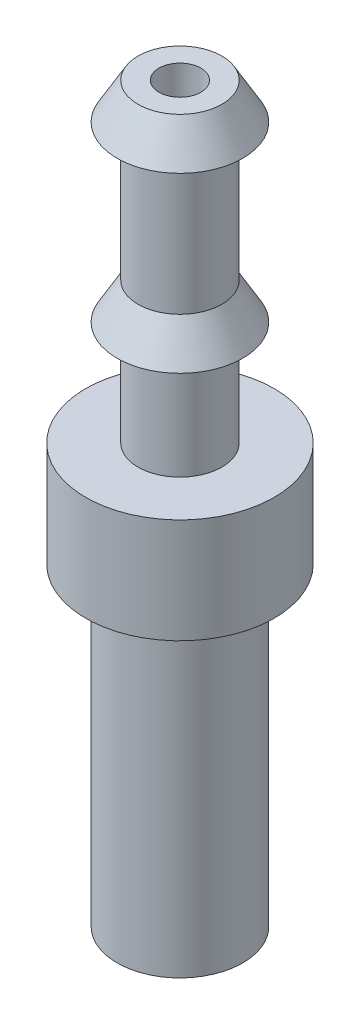
ISO-10303-21;
HEADER;
FILE_DESCRIPTION(('STEP AP214'),'2;1');
FILE_NAME('part.step','',(''),(''),'','','');
FILE_SCHEMA(('AUTOMOTIVE_DESIGN { 1 0 10303 214 1 1 1 1 }'));
ENDSEC;
DATA;
#1=APPLICATION_CONTEXT('core data for automotive mechanical design processes');
#2=APPLICATION_PROTOCOL_DEFINITION('international standard','automotive_design',2000,#1);
#3=PRODUCT_CONTEXT('',#1,'mechanical');
#4=PRODUCT('Part','Part','',(#3));
#5=PRODUCT_RELATED_PRODUCT_CATEGORY('part','',(#4));
#6=PRODUCT_DEFINITION_FORMATION('','',#4);
#7=PRODUCT_DEFINITION_CONTEXT('part definition',#1,'design');
#8=PRODUCT_DEFINITION('design','',#6,#7);
#9=PRODUCT_DEFINITION_SHAPE('','',#8);
#10=(LENGTH_UNIT() NAMED_UNIT(*) SI_UNIT(.MILLI.,.METRE.));
#11=(NAMED_UNIT(*) PLANE_ANGLE_UNIT() SI_UNIT($,.RADIAN.));
#12=(NAMED_UNIT(*) SI_UNIT($,.STERADIAN.) SOLID_ANGLE_UNIT());
#13=UNCERTAINTY_MEASURE_WITH_UNIT(LENGTH_MEASURE(1.E-05),#10,'distance_accuracy_value','');
#14=(GEOMETRIC_REPRESENTATION_CONTEXT(3) GLOBAL_UNCERTAINTY_ASSIGNED_CONTEXT((#13)) GLOBAL_UNIT_ASSIGNED_CONTEXT((#10,
#11,#12)) REPRESENTATION_CONTEXT('',''));
#15=CARTESIAN_POINT('',(0.,0.,0.));
#16=DIRECTION('',(0.,0.,1.));
#17=DIRECTION('',(1.,0.,0.));
#18=AXIS2_PLACEMENT_3D('',#15,#16,#17);
#19=CARTESIAN_POINT('',(0.,0.,0.));
#20=DIRECTION('',(0.,-1.,0.));
#21=DIRECTION('',(0.,0.,-1.));
#22=AXIS2_PLACEMENT_3D('',#19,#20,#21);
#23=CYLINDRICAL_SURFACE('',#22,3.);
#24=CARTESIAN_POINT('',(0.,-15.,0.));
#25=DIRECTION('',(0.,-1.,0.));
#26=DIRECTION('',(0.,0.,-1.));
#27=AXIS2_PLACEMENT_3D('',#24,#25,#26);
#28=CIRCLE('',#27,3.);
#29=CARTESIAN_POINT('',(0.,-15.,-3.));
#30=VERTEX_POINT('',#29);
#31=EDGE_CURVE('E10',#30,#30,#28,.T.);
#32=ORIENTED_EDGE('',*,*,#31,.F.);
#33=EDGE_LOOP('',(#32));
#34=FACE_BOUND('',#33,.T.);
#35=CARTESIAN_POINT('',(0.,0.,0.));
#36=DIRECTION('',(0.,-1.,0.));
#37=DIRECTION('',(0.,0.,-1.));
#38=AXIS2_PLACEMENT_3D('',#35,#36,#37);
#39=CIRCLE('',#38,3.);
#40=CARTESIAN_POINT('',(0.,0.,-3.));
#41=VERTEX_POINT('',#40);
#42=EDGE_CURVE('E78',#41,#41,#39,.T.);
#43=ORIENTED_EDGE('',*,*,#42,.T.);
#44=EDGE_LOOP('',(#43));
#45=FACE_BOUND('',#44,.T.);
#46=ADVANCED_FACE('F35',(#34,#45),#23,.T.);
#47=CARTESIAN_POINT('',(-0.999999999999998,-15.,0.));
#48=DIRECTION('',(0.,1.,0.));
#49=DIRECTION('',(0.,0.,1.));
#50=AXIS2_PLACEMENT_3D('',#47,#48,#49);
#51=PLANE('',#50);
#52=CARTESIAN_POINT('',(0.,-15.,0.));
#53=DIRECTION('',(0.,-1.,0.));
#54=DIRECTION('',(0.,0.,-1.));
#55=AXIS2_PLACEMENT_3D('',#52,#53,#54);
#56=CIRCLE('',#55,0.999999999999998);
#57=CARTESIAN_POINT('',(0.,-15.,-0.999999999999998));
#58=VERTEX_POINT('',#57);
#59=EDGE_CURVE('E41',#58,#58,#56,.T.);
#60=ORIENTED_EDGE('',*,*,#59,.F.);
#61=EDGE_LOOP('',(#60));
#62=FACE_BOUND('',#61,.T.);
#63=ORIENTED_EDGE('',*,*,#31,.T.);
#64=EDGE_LOOP('',(#63));
#65=FACE_BOUND('',#64,.T.);
#66=ADVANCED_FACE('F145',(#62,#65),#51,.F.);
#67=CARTESIAN_POINT('',(0.,0.,0.));
#68=DIRECTION('',(0.,-1.,0.));
#69=DIRECTION('',(0.,0.,-1.));
#70=AXIS2_PLACEMENT_3D('',#67,#68,#69);
#71=CYLINDRICAL_SURFACE('',#70,1.);
#72=CARTESIAN_POINT('',(0.,20.,0.));
#73=DIRECTION('',(0.,-1.,0.));
#74=DIRECTION('',(0.,0.,-1.));
#75=AXIS2_PLACEMENT_3D('',#72,#73,#74);
#76=CIRCLE('',#75,1.);
#77=CARTESIAN_POINT('',(0.,20.,-1.));
#78=VERTEX_POINT('',#77);
#79=EDGE_CURVE('E45',#78,#78,#76,.T.);
#80=ORIENTED_EDGE('',*,*,#79,.F.);
#81=EDGE_LOOP('',(#80));
#82=FACE_BOUND('',#81,.T.);
#83=ORIENTED_EDGE('',*,*,#59,.T.);
#84=EDGE_LOOP('',(#83));
#85=FACE_BOUND('',#84,.T.);
#86=ADVANCED_FACE('F140',(#82,#85),#71,.F.);
#87=CARTESIAN_POINT('',(-2.,20.,0.));
#88=DIRECTION('',(0.,-1.,0.));
#89=DIRECTION('',(0.,0.,-1.));
#90=AXIS2_PLACEMENT_3D('',#87,#88,#89);
#91=PLANE('',#90);
#92=CARTESIAN_POINT('',(0.,20.,0.));
#93=DIRECTION('',(0.,-1.,0.));
#94=DIRECTION('',(0.,0.,-1.));
#95=AXIS2_PLACEMENT_3D('',#92,#93,#94);
#96=CIRCLE('',#95,2.);
#97=CARTESIAN_POINT('',(0.,20.,-2.));
#98=VERTEX_POINT('',#97);
#99=EDGE_CURVE('E49',#98,#98,#96,.T.);
#100=ORIENTED_EDGE('',*,*,#99,.F.);
#101=EDGE_LOOP('',(#100));
#102=FACE_BOUND('',#101,.T.);
#103=ORIENTED_EDGE('',*,*,#79,.T.);
#104=EDGE_LOOP('',(#103));
#105=FACE_BOUND('',#104,.T.);
#106=ADVANCED_FACE('F134',(#102,#105),#91,.F.);
#107=CARTESIAN_POINT('',(0.,20.,0.));
#108=DIRECTION('',(0.,-1.,0.));
#109=DIRECTION('',(0.,0.,-1.));
#110=AXIS2_PLACEMENT_3D('',#107,#108,#109);
#111=CONICAL_SURFACE('',#110,2.,0.523598775598303);
#112=CARTESIAN_POINT('',(0.,18.2679491924311,0.));
#113=DIRECTION('',(0.,-1.,0.));
#114=DIRECTION('',(0.,0.,-1.));
#115=AXIS2_PLACEMENT_3D('',#112,#113,#114);
#116=CIRCLE('',#115,3.);
#117=CARTESIAN_POINT('',(0.,18.2679491924311,-3.));
#118=VERTEX_POINT('',#117);
#119=EDGE_CURVE('E54',#118,#118,#116,.T.);
#120=ORIENTED_EDGE('',*,*,#119,.F.);
#121=EDGE_LOOP('',(#120));
#122=FACE_BOUND('',#121,.T.);
#123=ORIENTED_EDGE('',*,*,#99,.T.);
#124=EDGE_LOOP('',(#123));
#125=FACE_BOUND('',#124,.T.);
#126=ADVANCED_FACE('F128',(#122,#125),#111,.T.);
#127=CARTESIAN_POINT('',(-2.,18.2679491924311,0.));
#128=DIRECTION('',(0.,1.,0.));
#129=DIRECTION('',(0.,0.,1.));
#130=AXIS2_PLACEMENT_3D('',#127,#128,#129);
#131=PLANE('',#130);
#132=CARTESIAN_POINT('',(0.,18.2679491924311,0.));
#133=DIRECTION('',(0.,-1.,0.));
#134=DIRECTION('',(0.,0.,-1.));
#135=AXIS2_PLACEMENT_3D('',#132,#133,#134);
#136=CIRCLE('',#135,2.);
#137=CARTESIAN_POINT('',(0.,18.2679491924311,-2.));
#138=VERTEX_POINT('',#137);
#139=EDGE_CURVE('E57',#138,#138,#136,.T.);
#140=ORIENTED_EDGE('',*,*,#139,.F.);
#141=EDGE_LOOP('',(#140));
#142=FACE_BOUND('',#141,.T.);
#143=ORIENTED_EDGE('',*,*,#119,.T.);
#144=EDGE_LOOP('',(#143));
#145=FACE_BOUND('',#144,.T.);
#146=ADVANCED_FACE('F122',(#142,#145),#131,.F.);
#147=CARTESIAN_POINT('',(0.,0.,0.));
#148=DIRECTION('',(0.,-1.,0.));
#149=DIRECTION('',(0.,0.,-1.));
#150=AXIS2_PLACEMENT_3D('',#147,#148,#149);
#151=CYLINDRICAL_SURFACE('',#150,2.);
#152=CARTESIAN_POINT('',(0.,11.7320508075689,0.));
#153=DIRECTION('',(0.,-1.,0.));
#154=DIRECTION('',(0.,0.,-1.));
#155=AXIS2_PLACEMENT_3D('',#152,#153,#154);
#156=CIRCLE('',#155,2.);
#157=CARTESIAN_POINT('',(0.,11.7320508075689,-2.));
#158=VERTEX_POINT('',#157);
#159=EDGE_CURVE('E60',#158,#158,#156,.T.);
#160=ORIENTED_EDGE('',*,*,#159,.F.);
#161=EDGE_LOOP('',(#160));
#162=FACE_BOUND('',#161,.T.);
#163=ORIENTED_EDGE('',*,*,#139,.T.);
#164=EDGE_LOOP('',(#163));
#165=FACE_BOUND('',#164,.T.);
#166=ADVANCED_FACE('F116',(#162,#165),#151,.T.);
#167=CARTESIAN_POINT('',(0.,11.7320508075689,0.));
#168=DIRECTION('',(0.,-1.,0.));
#169=DIRECTION('',(0.,0.,-1.));
#170=AXIS2_PLACEMENT_3D('',#167,#168,#169);
#171=CONICAL_SURFACE('',#170,2.,0.523598775598304);
#172=CARTESIAN_POINT('',(0.,10.,0.));
#173=DIRECTION('',(0.,-1.,0.));
#174=DIRECTION('',(0.,0.,-1.));
#175=AXIS2_PLACEMENT_3D('',#172,#173,#174);
#176=CIRCLE('',#175,3.);
#177=CARTESIAN_POINT('',(0.,10.,-3.));
#178=VERTEX_POINT('',#177);
#179=EDGE_CURVE('E63',#178,#178,#176,.T.);
#180=ORIENTED_EDGE('',*,*,#179,.F.);
#181=EDGE_LOOP('',(#180));
#182=FACE_BOUND('',#181,.T.);
#183=ORIENTED_EDGE('',*,*,#159,.T.);
#184=EDGE_LOOP('',(#183));
#185=FACE_BOUND('',#184,.T.);
#186=ADVANCED_FACE('F110',(#182,#185),#171,.T.);
#187=CARTESIAN_POINT('',(-2.,10.,0.));
#188=DIRECTION('',(0.,1.,0.));
#189=DIRECTION('',(0.,0.,1.));
#190=AXIS2_PLACEMENT_3D('',#187,#188,#189);
#191=PLANE('',#190);
#192=CARTESIAN_POINT('',(0.,10.,0.));
#193=DIRECTION('',(0.,-1.,0.));
#194=DIRECTION('',(0.,0.,-1.));
#195=AXIS2_PLACEMENT_3D('',#192,#193,#194);
#196=CIRCLE('',#195,2.);
#197=CARTESIAN_POINT('',(0.,10.,-2.));
#198=VERTEX_POINT('',#197);
#199=EDGE_CURVE('E66',#198,#198,#196,.T.);
#200=ORIENTED_EDGE('',*,*,#199,.F.);
#201=EDGE_LOOP('',(#200));
#202=FACE_BOUND('',#201,.T.);
#203=ORIENTED_EDGE('',*,*,#179,.T.);
#204=EDGE_LOOP('',(#203));
#205=FACE_BOUND('',#204,.T.);
#206=ADVANCED_FACE('F104',(#202,#205),#191,.F.);
#207=CARTESIAN_POINT('',(0.,0.,0.));
#208=DIRECTION('',(0.,-1.,0.));
#209=DIRECTION('',(0.,0.,-1.));
#210=AXIS2_PLACEMENT_3D('',#207,#208,#209);
#211=CYLINDRICAL_SURFACE('',#210,2.);
#212=CARTESIAN_POINT('',(0.,5.,0.));
#213=DIRECTION('',(0.,-1.,0.));
#214=DIRECTION('',(0.,0.,-1.));
#215=AXIS2_PLACEMENT_3D('',#212,#213,#214);
#216=CIRCLE('',#215,2.);
#217=CARTESIAN_POINT('',(0.,5.,-2.));
#218=VERTEX_POINT('',#217);
#219=EDGE_CURVE('E69',#218,#218,#216,.T.);
#220=ORIENTED_EDGE('',*,*,#219,.F.);
#221=EDGE_LOOP('',(#220));
#222=FACE_BOUND('',#221,.T.);
#223=ORIENTED_EDGE('',*,*,#199,.T.);
#224=EDGE_LOOP('',(#223));
#225=FACE_BOUND('',#224,.T.);
#226=ADVANCED_FACE('F98',(#222,#225),#211,.T.);
#227=CARTESIAN_POINT('',(-4.5,5.,0.));
#228=DIRECTION('',(0.,-1.,0.));
#229=DIRECTION('',(0.,0.,-1.));
#230=AXIS2_PLACEMENT_3D('',#227,#228,#229);
#231=PLANE('',#230);
#232=CARTESIAN_POINT('',(0.,5.,0.));
#233=DIRECTION('',(0.,-1.,0.));
#234=DIRECTION('',(0.,0.,-1.));
#235=AXIS2_PLACEMENT_3D('',#232,#233,#234);
#236=CIRCLE('',#235,4.5);
#237=CARTESIAN_POINT('',(0.,5.,-4.5));
#238=VERTEX_POINT('',#237);
#239=EDGE_CURVE('E72',#238,#238,#236,.T.);
#240=ORIENTED_EDGE('',*,*,#239,.F.);
#241=EDGE_LOOP('',(#240));
#242=FACE_BOUND('',#241,.T.);
#243=ORIENTED_EDGE('',*,*,#219,.T.);
#244=EDGE_LOOP('',(#243));
#245=FACE_BOUND('',#244,.T.);
#246=ADVANCED_FACE('F92',(#242,#245),#231,.F.);
#247=CARTESIAN_POINT('',(0.,0.,0.));
#248=DIRECTION('',(0.,-1.,0.));
#249=DIRECTION('',(0.,0.,-1.));
#250=AXIS2_PLACEMENT_3D('',#247,#248,#249);
#251=CYLINDRICAL_SURFACE('',#250,4.5);
#252=CARTESIAN_POINT('',(0.,0.,0.));
#253=DIRECTION('',(0.,-1.,0.));
#254=DIRECTION('',(0.,0.,-1.));
#255=AXIS2_PLACEMENT_3D('',#252,#253,#254);
#256=CIRCLE('',#255,4.5);
#257=CARTESIAN_POINT('',(0.,0.,-4.5));
#258=VERTEX_POINT('',#257);
#259=EDGE_CURVE('E75',#258,#258,#256,.T.);
#260=ORIENTED_EDGE('',*,*,#259,.F.);
#261=EDGE_LOOP('',(#260));
#262=FACE_BOUND('',#261,.T.);
#263=ORIENTED_EDGE('',*,*,#239,.T.);
#264=EDGE_LOOP('',(#263));
#265=FACE_BOUND('',#264,.T.);
#266=ADVANCED_FACE('F86',(#262,#265),#251,.T.);
#267=CARTESIAN_POINT('',(-3.,0.,0.));
#268=DIRECTION('',(0.,1.,0.));
#269=DIRECTION('',(0.,0.,1.));
#270=AXIS2_PLACEMENT_3D('',#267,#268,#269);
#271=PLANE('',#270);
#272=ORIENTED_EDGE('',*,*,#42,.F.);
#273=EDGE_LOOP('',(#272));
#274=FACE_BOUND('',#273,.T.);
#275=ORIENTED_EDGE('',*,*,#259,.T.);
#276=EDGE_LOOP('',(#275));
#277=FACE_BOUND('',#276,.T.);
#278=ADVANCED_FACE('F83',(#274,#277),#271,.F.);
#279=CLOSED_SHELL('',(#46,#66,#86,#106,#126,#146,#166,#186,#206,#226,#246,#266,#278));
#280=MANIFOLD_SOLID_BREP('B2',#279);
#281=ADVANCED_BREP_SHAPE_REPRESENTATION('',(#18,#280),#14);
#282=SHAPE_DEFINITION_REPRESENTATION(#9,#281);
ENDSEC;
END-ISO-10303-21;
